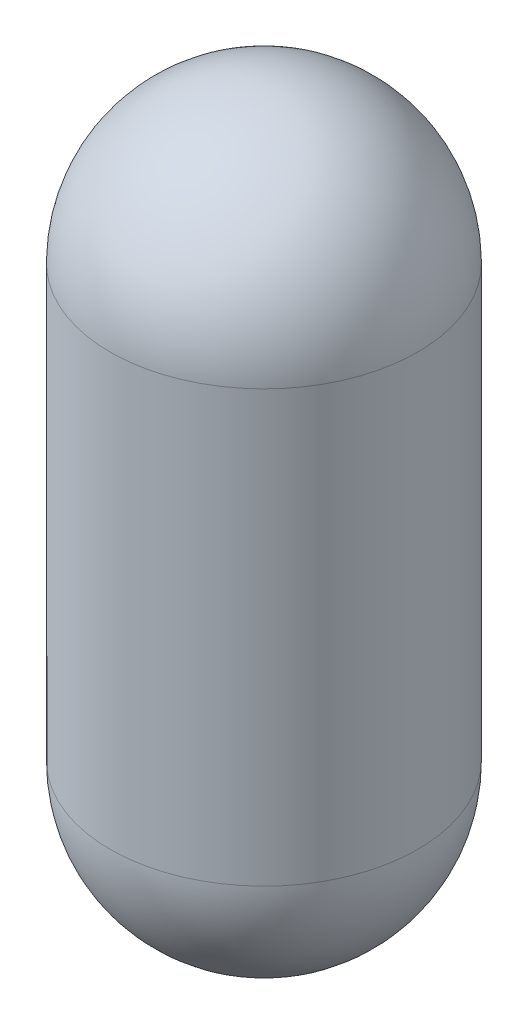
ISO-10303-21;
HEADER;
FILE_DESCRIPTION(('STEP AP214'),'2;1');
FILE_NAME('part.step','',(''),(''),'','','');
FILE_SCHEMA(('AUTOMOTIVE_DESIGN { 1 0 10303 214 1 1 1 1 }'));
ENDSEC;
DATA;
#1=APPLICATION_CONTEXT('core data for automotive mechanical design processes');
#2=APPLICATION_PROTOCOL_DEFINITION('international standard','automotive_design',2000,#1);
#3=PRODUCT_CONTEXT('',#1,'mechanical');
#4=PRODUCT('Part','Part','',(#3));
#5=PRODUCT_RELATED_PRODUCT_CATEGORY('part','',(#4));
#6=PRODUCT_DEFINITION_FORMATION('','',#4);
#7=PRODUCT_DEFINITION_CONTEXT('part definition',#1,'design');
#8=PRODUCT_DEFINITION('design','',#6,#7);
#9=PRODUCT_DEFINITION_SHAPE('','',#8);
#10=(LENGTH_UNIT() NAMED_UNIT(*) SI_UNIT(.MILLI.,.METRE.));
#11=(NAMED_UNIT(*) PLANE_ANGLE_UNIT() SI_UNIT($,.RADIAN.));
#12=(NAMED_UNIT(*) SI_UNIT($,.STERADIAN.) SOLID_ANGLE_UNIT());
#13=UNCERTAINTY_MEASURE_WITH_UNIT(LENGTH_MEASURE(1.E-05),#10,'distance_accuracy_value','');
#14=(GEOMETRIC_REPRESENTATION_CONTEXT(3) GLOBAL_UNCERTAINTY_ASSIGNED_CONTEXT((#13)) GLOBAL_UNIT_ASSIGNED_CONTEXT((#10,
#11,#12)) REPRESENTATION_CONTEXT('',''));
#15=CARTESIAN_POINT('',(0.,0.,0.));
#16=DIRECTION('',(0.,0.,1.));
#17=DIRECTION('',(1.,0.,0.));
#18=AXIS2_PLACEMENT_3D('',#15,#16,#17);
#19=CARTESIAN_POINT('',(125.,0.,0.));
#20=DIRECTION('',(0.,1.,0.));
#21=DIRECTION('',(-1.,0.,0.));
#22=AXIS2_PLACEMENT_3D('',#19,#20,#21);
#23=SPHERICAL_SURFACE('',#22,125.);
#24=CARTESIAN_POINT('',(125.,0.,0.));
#25=DIRECTION('',(0.,1.,0.));
#26=DIRECTION('',(-1.,0.,0.));
#27=AXIS2_PLACEMENT_3D('',#24,#25,#26);
#28=CIRCLE('',#27,125.);
#29=CARTESIAN_POINT('',(0.,0.,0.));
#30=VERTEX_POINT('',#29);
#31=EDGE_CURVE('E47',#30,#30,#28,.T.);
#32=ORIENTED_EDGE('',*,*,#31,.F.);
#33=EDGE_LOOP('',(#32));
#34=FACE_BOUND('',#33,.T.);
#35=ADVANCED_FACE('F32',(#34),#23,.T.);
#36=CARTESIAN_POINT('',(125.,350.,0.));
#37=DIRECTION('',(0.,1.,0.));
#38=DIRECTION('',(-1.,0.,0.));
#39=AXIS2_PLACEMENT_3D('',#36,#37,#38);
#40=SPHERICAL_SURFACE('',#39,125.);
#41=CARTESIAN_POINT('',(125.,350.,0.));
#42=DIRECTION('',(0.,1.,0.));
#43=DIRECTION('',(-1.,0.,0.));
#44=AXIS2_PLACEMENT_3D('',#41,#42,#43);
#45=CIRCLE('',#44,125.);
#46=CARTESIAN_POINT('',(0.,350.,0.));
#47=VERTEX_POINT('',#46);
#48=EDGE_CURVE('E43',#47,#47,#45,.T.);
#49=ORIENTED_EDGE('',*,*,#48,.T.);
#50=EDGE_LOOP('',(#49));
#51=FACE_BOUND('',#50,.T.);
#52=ADVANCED_FACE('F57',(#51),#40,.T.);
#53=CARTESIAN_POINT('',(125.,475.,0.));
#54=DIRECTION('',(0.,1.,0.));
#55=DIRECTION('',(-1.,0.,0.));
#56=AXIS2_PLACEMENT_3D('',#53,#54,#55);
#57=CYLINDRICAL_SURFACE('',#56,125.);
#58=ORIENTED_EDGE('',*,*,#31,.T.);
#59=EDGE_LOOP('',(#58));
#60=FACE_BOUND('',#59,.T.);
#61=ORIENTED_EDGE('',*,*,#48,.F.);
#62=EDGE_LOOP('',(#61));
#63=FACE_BOUND('',#62,.T.);
#64=ADVANCED_FACE('F53',(#60,#63),#57,.T.);
#65=CLOSED_SHELL('',(#35,#52,#64));
#66=CARTESIAN_POINT('',(125.,0.,0.));
#67=DIRECTION('',(0.,1.,0.));
#68=DIRECTION('',(-1.,0.,0.));
#69=AXIS2_PLACEMENT_3D('',#66,#67,#68);
#70=SPHERICAL_SURFACE('',#69,115.);
#71=CARTESIAN_POINT('',(125.,0.,0.));
#72=DIRECTION('',(0.,1.,0.));
#73=DIRECTION('',(-1.,0.,0.));
#74=AXIS2_PLACEMENT_3D('',#71,#72,#73);
#75=CIRCLE('',#74,115.);
#76=CARTESIAN_POINT('',(9.99999999999999,0.,0.));
#77=VERTEX_POINT('',#76);
#78=EDGE_CURVE('E10',#77,#77,#75,.T.);
#79=ORIENTED_EDGE('',*,*,#78,.T.);
#80=EDGE_LOOP('',(#79));
#81=FACE_BOUND('',#80,.T.);
#82=ADVANCED_FACE('F75',(#81),#70,.F.);
#83=CARTESIAN_POINT('',(125.,475.,0.));
#84=DIRECTION('',(0.,1.,0.));
#85=DIRECTION('',(-1.,0.,0.));
#86=AXIS2_PLACEMENT_3D('',#83,#84,#85);
#87=CYLINDRICAL_SURFACE('',#86,115.);
#88=CARTESIAN_POINT('',(125.,350.,0.));
#89=DIRECTION('',(0.,1.,0.));
#90=DIRECTION('',(-1.,0.,0.));
#91=AXIS2_PLACEMENT_3D('',#88,#89,#90);
#92=CIRCLE('',#91,115.);
#93=CARTESIAN_POINT('',(10.,350.,0.));
#94=VERTEX_POINT('',#93);
#95=EDGE_CURVE('E39',#94,#94,#92,.T.);
#96=ORIENTED_EDGE('',*,*,#95,.T.);
#97=EDGE_LOOP('',(#96));
#98=FACE_BOUND('',#97,.T.);
#99=ORIENTED_EDGE('',*,*,#78,.F.);
#100=EDGE_LOOP('',(#99));
#101=FACE_BOUND('',#100,.T.);
#102=ADVANCED_FACE('F71',(#98,#101),#87,.F.);
#103=CARTESIAN_POINT('',(125.,350.,0.));
#104=DIRECTION('',(0.,1.,0.));
#105=DIRECTION('',(-1.,0.,0.));
#106=AXIS2_PLACEMENT_3D('',#103,#104,#105);
#107=SPHERICAL_SURFACE('',#106,115.);
#108=ORIENTED_EDGE('',*,*,#95,.F.);
#109=EDGE_LOOP('',(#108));
#110=FACE_BOUND('',#109,.T.);
#111=ADVANCED_FACE('F68',(#110),#107,.F.);
#112=CLOSED_SHELL('',(#82,#102,#111));
#113=ORIENTED_CLOSED_SHELL('',*,#112,.T.);
#114=BREP_WITH_VOIDS('B2',#65,(#113));
#115=ADVANCED_BREP_SHAPE_REPRESENTATION('',(#18,#114),#14);
#116=SHAPE_DEFINITION_REPRESENTATION(#9,#115);
ENDSEC;
END-ISO-10303-21;
